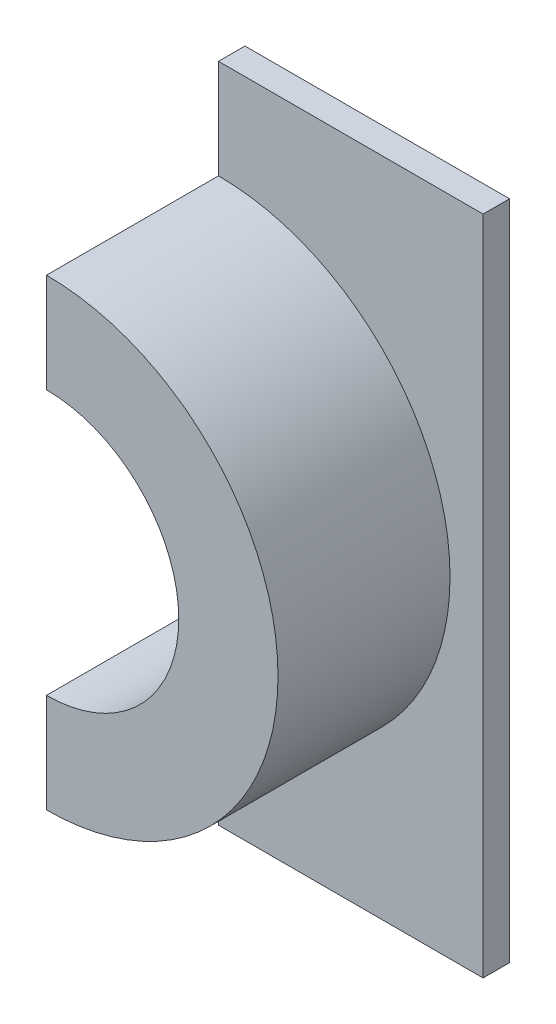
ISO-10303-21;
HEADER;
FILE_DESCRIPTION(('STEP AP214'),'2;1');
FILE_NAME('part.step','',(''),(''),'','','');
FILE_SCHEMA(('AUTOMOTIVE_DESIGN { 1 0 10303 214 1 1 1 1 }'));
ENDSEC;
DATA;
#1=APPLICATION_CONTEXT('core data for automotive mechanical design processes');
#2=APPLICATION_PROTOCOL_DEFINITION('international standard','automotive_design',2000,#1);
#3=PRODUCT_CONTEXT('',#1,'mechanical');
#4=PRODUCT('Part','Part','',(#3));
#5=PRODUCT_RELATED_PRODUCT_CATEGORY('part','',(#4));
#6=PRODUCT_DEFINITION_FORMATION('','',#4);
#7=PRODUCT_DEFINITION_CONTEXT('part definition',#1,'design');
#8=PRODUCT_DEFINITION('design','',#6,#7);
#9=PRODUCT_DEFINITION_SHAPE('','',#8);
#10=(LENGTH_UNIT() NAMED_UNIT(*) SI_UNIT(.MILLI.,.METRE.));
#11=(NAMED_UNIT(*) PLANE_ANGLE_UNIT() SI_UNIT($,.RADIAN.));
#12=(NAMED_UNIT(*) SI_UNIT($,.STERADIAN.) SOLID_ANGLE_UNIT());
#13=UNCERTAINTY_MEASURE_WITH_UNIT(LENGTH_MEASURE(1.E-05),#10,'distance_accuracy_value','');
#14=(GEOMETRIC_REPRESENTATION_CONTEXT(3) GLOBAL_UNCERTAINTY_ASSIGNED_CONTEXT((#13)) GLOBAL_UNIT_ASSIGNED_CONTEXT((#10,
#11,#12)) REPRESENTATION_CONTEXT('',''));
#15=CARTESIAN_POINT('',(0.,0.,0.));
#16=DIRECTION('',(0.,0.,1.));
#17=DIRECTION('',(1.,0.,0.));
#18=AXIS2_PLACEMENT_3D('',#15,#16,#17);
#19=CARTESIAN_POINT('',(-0.2,0.,0.04));
#20=DIRECTION('',(0.,0.,-1.));
#21=DIRECTION('',(-1.,0.,0.));
#22=AXIS2_PLACEMENT_3D('',#19,#20,#21);
#23=CYLINDRICAL_SURFACE('',#22,0.35);
#24=CARTESIAN_POINT('',(-0.2,0.,0.04));
#25=DIRECTION('',(0.,0.,-1.));
#26=DIRECTION('',(-1.,0.,0.));
#27=AXIS2_PLACEMENT_3D('',#24,#25,#26);
#28=CIRCLE('',#27,0.35);
#29=CARTESIAN_POINT('',(-0.2,0.35,0.04));
#30=VERTEX_POINT('',#29);
#31=CARTESIAN_POINT('',(-0.2,-0.35,0.04));
#32=VERTEX_POINT('',#31);
#33=EDGE_CURVE('E19',#30,#32,#28,.T.);
#34=ORIENTED_EDGE('',*,*,#33,.F.);
#35=DIRECTION('',(0.,0.,-1.));
#36=VECTOR('',#35,1.);
#37=CARTESIAN_POINT('',(-0.2,0.35,0.3));
#38=LINE('',#37,#36);
#39=CARTESIAN_POINT('',(-0.2,0.35,0.3));
#40=VERTEX_POINT('',#39);
#41=EDGE_CURVE('E116',#30,#40,#38,.F.);
#42=ORIENTED_EDGE('',*,*,#41,.T.);
#43=CARTESIAN_POINT('',(-0.2,0.,0.3));
#44=DIRECTION('',(0.,0.,-1.));
#45=DIRECTION('',(-1.,0.,0.));
#46=AXIS2_PLACEMENT_3D('',#43,#44,#45);
#47=CIRCLE('',#46,0.35);
#48=CARTESIAN_POINT('',(-0.2,-0.35,0.3));
#49=VERTEX_POINT('',#48);
#50=EDGE_CURVE('E93',#49,#40,#47,.F.);
#51=ORIENTED_EDGE('',*,*,#50,.F.);
#52=DIRECTION('',(0.,0.,-1.));
#53=VECTOR('',#52,1.);
#54=CARTESIAN_POINT('',(-0.2,-0.35,0.3));
#55=LINE('',#54,#53);
#56=EDGE_CURVE('E95',#49,#32,#55,.T.);
#57=ORIENTED_EDGE('',*,*,#56,.T.);
#58=EDGE_LOOP('',(#34,#42,#51,#57));
#59=FACE_BOUND('',#58,.T.);
#60=ADVANCED_FACE('F16',(#59),#23,.T.);
#61=CARTESIAN_POINT('',(-0.2,-0.5,0.04));
#62=DIRECTION('',(0.,0.,1.));
#63=DIRECTION('',(1.,0.,0.));
#64=AXIS2_PLACEMENT_3D('',#61,#62,#63);
#65=PLANE('',#64);
#66=DIRECTION('',(0.,1.,0.));
#67=VECTOR('',#66,1.);
#68=CARTESIAN_POINT('',(-0.2,0.35,0.04));
#69=LINE('',#68,#67);
#70=CARTESIAN_POINT('',(-0.2,-0.5,0.04));
#71=VERTEX_POINT('',#70);
#72=EDGE_CURVE('E91',#32,#71,#69,.F.);
#73=ORIENTED_EDGE('',*,*,#72,.T.);
#74=DIRECTION('',(1.,0.,0.));
#75=VECTOR('',#74,1.);
#76=CARTESIAN_POINT('',(-0.2,-0.5,0.04));
#77=LINE('',#76,#75);
#78=CARTESIAN_POINT('',(0.2,-0.5,0.04));
#79=VERTEX_POINT('',#78);
#80=EDGE_CURVE('E86',#71,#79,#77,.T.);
#81=ORIENTED_EDGE('',*,*,#80,.T.);
#82=DIRECTION('',(0.,1.,0.));
#83=VECTOR('',#82,1.);
#84=CARTESIAN_POINT('',(0.2,-0.35,0.04));
#85=LINE('',#84,#83);
#86=CARTESIAN_POINT('',(0.2,0.5,0.04));
#87=VERTEX_POINT('',#86);
#88=EDGE_CURVE('E126',#79,#87,#85,.T.);
#89=ORIENTED_EDGE('',*,*,#88,.T.);
#90=DIRECTION('',(1.,0.,0.));
#91=VECTOR('',#90,1.);
#92=CARTESIAN_POINT('',(0.2,0.5,0.04));
#93=LINE('',#92,#91);
#94=CARTESIAN_POINT('',(-0.2,0.5,0.04));
#95=VERTEX_POINT('',#94);
#96=EDGE_CURVE('E68',#87,#95,#93,.F.);
#97=ORIENTED_EDGE('',*,*,#96,.T.);
#98=DIRECTION('',(0.,1.,0.));
#99=VECTOR('',#98,1.);
#100=CARTESIAN_POINT('',(-0.2,0.35,0.04));
#101=LINE('',#100,#99);
#102=EDGE_CURVE('E92',#95,#30,#101,.F.);
#103=ORIENTED_EDGE('',*,*,#102,.T.);
#104=ORIENTED_EDGE('',*,*,#33,.T.);
#105=EDGE_LOOP('',(#73,#81,#89,#97,#103,#104));
#106=FACE_BOUND('',#105,.T.);
#107=ADVANCED_FACE('F90',(#106),#65,.T.);
#108=CARTESIAN_POINT('',(-0.2,-0.35,0.3));
#109=DIRECTION('',(0.,0.,1.));
#110=DIRECTION('',(1.,0.,0.));
#111=AXIS2_PLACEMENT_3D('',#108,#109,#110);
#112=PLANE('',#111);
#113=CARTESIAN_POINT('',(-0.2,0.,0.3));
#114=DIRECTION('',(0.,0.,1.));
#115=DIRECTION('',(1.,0.,0.));
#116=AXIS2_PLACEMENT_3D('',#113,#114,#115);
#117=CIRCLE('',#116,0.2);
#118=CARTESIAN_POINT('',(-0.2,0.2,0.3));
#119=VERTEX_POINT('',#118);
#120=CARTESIAN_POINT('',(-0.2,-0.2,0.3));
#121=VERTEX_POINT('',#120);
#122=EDGE_CURVE('E100',#119,#121,#117,.F.);
#123=ORIENTED_EDGE('',*,*,#122,.T.);
#124=DIRECTION('',(0.,1.,0.));
#125=VECTOR('',#124,1.);
#126=CARTESIAN_POINT('',(-0.2,0.35,0.3));
#127=LINE('',#126,#125);
#128=EDGE_CURVE('E106',#121,#49,#127,.F.);
#129=ORIENTED_EDGE('',*,*,#128,.T.);
#130=ORIENTED_EDGE('',*,*,#50,.T.);
#131=DIRECTION('',(0.,1.,0.));
#132=VECTOR('',#131,1.);
#133=CARTESIAN_POINT('',(-0.2,0.35,0.3));
#134=LINE('',#133,#132);
#135=EDGE_CURVE('E114',#40,#119,#134,.F.);
#136=ORIENTED_EDGE('',*,*,#135,.T.);
#137=EDGE_LOOP('',(#123,#129,#130,#136));
#138=FACE_BOUND('',#137,.T.);
#139=ADVANCED_FACE('F134',(#138),#112,.T.);
#140=CARTESIAN_POINT('',(-0.2,-0.5,0.04));
#141=DIRECTION('',(0.,1.,0.));
#142=DIRECTION('',(0.,0.,1.));
#143=AXIS2_PLACEMENT_3D('',#140,#141,#142);
#144=PLANE('',#143);
#145=DIRECTION('',(0.,0.,1.));
#146=VECTOR('',#145,1.);
#147=CARTESIAN_POINT('',(0.2,-0.5,0.3));
#148=LINE('',#147,#146);
#149=CARTESIAN_POINT('',(0.2,-0.5,0.));
#150=VERTEX_POINT('',#149);
#151=EDGE_CURVE('E109',#150,#79,#148,.T.);
#152=ORIENTED_EDGE('',*,*,#151,.T.);
#153=ORIENTED_EDGE('',*,*,#80,.F.);
#154=DIRECTION('',(0.,0.,-1.));
#155=VECTOR('',#154,1.);
#156=CARTESIAN_POINT('',(-0.2,-0.5,0.3));
#157=LINE('',#156,#155);
#158=CARTESIAN_POINT('',(-0.2,-0.5,0.));
#159=VERTEX_POINT('',#158);
#160=EDGE_CURVE('E97',#71,#159,#157,.T.);
#161=ORIENTED_EDGE('',*,*,#160,.T.);
#162=DIRECTION('',(1.,0.,0.));
#163=VECTOR('',#162,1.);
#164=CARTESIAN_POINT('',(-0.2,-0.5,0.));
#165=LINE('',#164,#163);
#166=EDGE_CURVE('E165',#159,#150,#165,.T.);
#167=ORIENTED_EDGE('',*,*,#166,.T.);
#168=EDGE_LOOP('',(#152,#153,#161,#167));
#169=FACE_BOUND('',#168,.T.);
#170=ADVANCED_FACE('F170',(#169),#144,.F.);
#171=CARTESIAN_POINT('',(0.2,-0.35,0.3));
#172=DIRECTION('',(-1.,0.,0.));
#173=DIRECTION('',(0.,0.,1.));
#174=AXIS2_PLACEMENT_3D('',#171,#172,#173);
#175=PLANE('',#174);
#176=ORIENTED_EDGE('',*,*,#88,.F.);
#177=ORIENTED_EDGE('',*,*,#151,.F.);
#178=DIRECTION('',(0.,1.,0.));
#179=VECTOR('',#178,1.);
#180=CARTESIAN_POINT('',(0.2,-0.35,0.));
#181=LINE('',#180,#179);
#182=CARTESIAN_POINT('',(0.2,0.5,0.));
#183=VERTEX_POINT('',#182);
#184=EDGE_CURVE('E156',#150,#183,#181,.T.);
#185=ORIENTED_EDGE('',*,*,#184,.T.);
#186=DIRECTION('',(0.,0.,-1.));
#187=VECTOR('',#186,1.);
#188=CARTESIAN_POINT('',(0.2,0.5,0.04));
#189=LINE('',#188,#187);
#190=EDGE_CURVE('E123',#183,#87,#189,.F.);
#191=ORIENTED_EDGE('',*,*,#190,.T.);
#192=EDGE_LOOP('',(#176,#177,#185,#191));
#193=FACE_BOUND('',#192,.T.);
#194=ADVANCED_FACE('F175',(#193),#175,.F.);
#195=CARTESIAN_POINT('',(0.2,0.5,0.04));
#196=DIRECTION('',(0.,-1.,0.));
#197=DIRECTION('',(0.,0.,-1.));
#198=AXIS2_PLACEMENT_3D('',#195,#196,#197);
#199=PLANE('',#198);
#200=DIRECTION('',(0.,0.,-1.));
#201=VECTOR('',#200,1.);
#202=CARTESIAN_POINT('',(-0.2,0.5,0.3));
#203=LINE('',#202,#201);
#204=CARTESIAN_POINT('',(-0.2,0.5,0.));
#205=VERTEX_POINT('',#204);
#206=EDGE_CURVE('E119',#205,#95,#203,.F.);
#207=ORIENTED_EDGE('',*,*,#206,.T.);
#208=ORIENTED_EDGE('',*,*,#96,.F.);
#209=ORIENTED_EDGE('',*,*,#190,.F.);
#210=DIRECTION('',(1.,0.,0.));
#211=VECTOR('',#210,1.);
#212=CARTESIAN_POINT('',(-0.2,0.5,0.));
#213=LINE('',#212,#211);
#214=EDGE_CURVE('E153',#183,#205,#213,.F.);
#215=ORIENTED_EDGE('',*,*,#214,.T.);
#216=EDGE_LOOP('',(#207,#208,#209,#215));
#217=FACE_BOUND('',#216,.T.);
#218=ADVANCED_FACE('F180',(#217),#199,.F.);
#219=CARTESIAN_POINT('',(-0.2,0.35,0.3));
#220=DIRECTION('',(1.,0.,0.));
#221=DIRECTION('',(0.,0.,-1.));
#222=AXIS2_PLACEMENT_3D('',#219,#220,#221);
#223=PLANE('',#222);
#224=DIRECTION('',(0.,0.,1.));
#225=VECTOR('',#224,1.);
#226=CARTESIAN_POINT('',(-0.2,0.2,1.204159457879));
#227=LINE('',#226,#225);
#228=CARTESIAN_POINT('',(-0.2,0.2,0.));
#229=VERTEX_POINT('',#228);
#230=EDGE_CURVE('E102',#229,#119,#227,.T.);
#231=ORIENTED_EDGE('',*,*,#230,.T.);
#232=ORIENTED_EDGE('',*,*,#135,.F.);
#233=ORIENTED_EDGE('',*,*,#41,.F.);
#234=ORIENTED_EDGE('',*,*,#102,.F.);
#235=ORIENTED_EDGE('',*,*,#206,.F.);
#236=DIRECTION('',(0.,1.,0.));
#237=VECTOR('',#236,1.);
#238=CARTESIAN_POINT('',(-0.2,-0.35,0.));
#239=LINE('',#238,#237);
#240=EDGE_CURVE('E131',#205,#229,#239,.F.);
#241=ORIENTED_EDGE('',*,*,#240,.T.);
#242=EDGE_LOOP('',(#231,#232,#233,#234,#235,#241));
#243=FACE_BOUND('',#242,.T.);
#244=ADVANCED_FACE('F138',(#243),#223,.F.);
#245=CARTESIAN_POINT('',(-0.2,0.,1.204159457879));
#246=DIRECTION('',(0.,0.,1.));
#247=DIRECTION('',(1.,0.,0.));
#248=AXIS2_PLACEMENT_3D('',#245,#246,#247);
#249=CYLINDRICAL_SURFACE('',#248,0.2);
#250=ORIENTED_EDGE('',*,*,#230,.F.);
#251=CARTESIAN_POINT('',(-0.2,0.,0.));
#252=DIRECTION('',(0.,0.,1.));
#253=DIRECTION('',(1.,0.,0.));
#254=AXIS2_PLACEMENT_3D('',#251,#252,#253);
#255=CIRCLE('',#254,0.2);
#256=CARTESIAN_POINT('',(-0.2,-0.2,0.));
#257=VERTEX_POINT('',#256);
#258=EDGE_CURVE('E25',#229,#257,#255,.F.);
#259=ORIENTED_EDGE('',*,*,#258,.T.);
#260=DIRECTION('',(0.,0.,-1.));
#261=VECTOR('',#260,1.);
#262=CARTESIAN_POINT('',(-0.2,-0.2,0.3));
#263=LINE('',#262,#261);
#264=EDGE_CURVE('E33',#257,#121,#263,.F.);
#265=ORIENTED_EDGE('',*,*,#264,.T.);
#266=ORIENTED_EDGE('',*,*,#122,.F.);
#267=EDGE_LOOP('',(#250,#259,#265,#266));
#268=FACE_BOUND('',#267,.T.);
#269=ADVANCED_FACE('F188',(#268),#249,.F.);
#270=CARTESIAN_POINT('',(-0.2,0.35,0.3));
#271=DIRECTION('',(1.,0.,0.));
#272=DIRECTION('',(0.,0.,-1.));
#273=AXIS2_PLACEMENT_3D('',#270,#271,#272);
#274=PLANE('',#273);
#275=ORIENTED_EDGE('',*,*,#264,.F.);
#276=DIRECTION('',(0.,1.,0.));
#277=VECTOR('',#276,1.);
#278=CARTESIAN_POINT('',(-0.2,-0.35,0.));
#279=LINE('',#278,#277);
#280=EDGE_CURVE('E11',#257,#159,#279,.F.);
#281=ORIENTED_EDGE('',*,*,#280,.T.);
#282=ORIENTED_EDGE('',*,*,#160,.F.);
#283=ORIENTED_EDGE('',*,*,#72,.F.);
#284=ORIENTED_EDGE('',*,*,#56,.F.);
#285=ORIENTED_EDGE('',*,*,#128,.F.);
#286=EDGE_LOOP('',(#275,#281,#282,#283,#284,#285));
#287=FACE_BOUND('',#286,.T.);
#288=ADVANCED_FACE('F94',(#287),#274,.F.);
#289=CARTESIAN_POINT('',(-0.2,-0.35,0.));
#290=DIRECTION('',(0.,0.,1.));
#291=DIRECTION('',(1.,0.,0.));
#292=AXIS2_PLACEMENT_3D('',#289,#290,#291);
#293=PLANE('',#292);
#294=ORIENTED_EDGE('',*,*,#258,.F.);
#295=ORIENTED_EDGE('',*,*,#240,.F.);
#296=ORIENTED_EDGE('',*,*,#214,.F.);
#297=ORIENTED_EDGE('',*,*,#184,.F.);
#298=ORIENTED_EDGE('',*,*,#166,.F.);
#299=ORIENTED_EDGE('',*,*,#280,.F.);
#300=EDGE_LOOP('',(#294,#295,#296,#297,#298,#299));
#301=FACE_BOUND('',#300,.T.);
#302=ADVANCED_FACE('F178',(#301),#293,.F.);
#303=CLOSED_SHELL('',(#60,#107,#139,#170,#194,#218,#244,#269,#288,#302));
#304=MANIFOLD_SOLID_BREP('B1',#303);
#305=ADVANCED_BREP_SHAPE_REPRESENTATION('',(#18,#304),#14);
#306=SHAPE_DEFINITION_REPRESENTATION(#9,#305);
ENDSEC;
END-ISO-10303-21;
